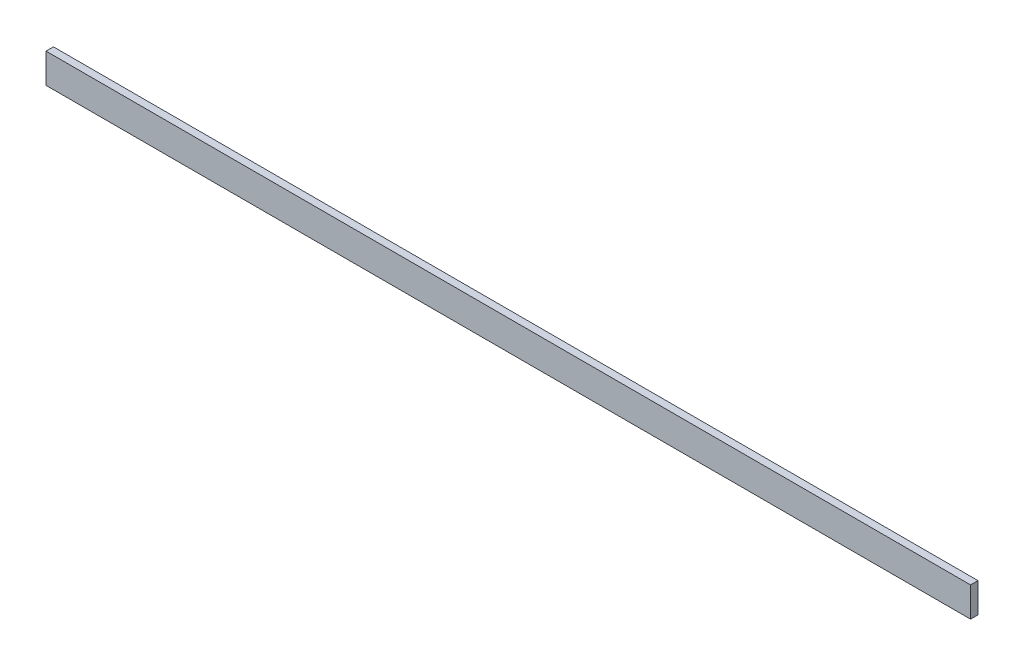
ISO-10303-21;
HEADER;
FILE_DESCRIPTION(('STEP AP214'),'2;1');
FILE_NAME('part.step','',(''),(''),'','','');
FILE_SCHEMA(('AUTOMOTIVE_DESIGN { 1 0 10303 214 1 1 1 1 }'));
ENDSEC;
DATA;
#1=APPLICATION_CONTEXT('core data for automotive mechanical design processes');
#2=APPLICATION_PROTOCOL_DEFINITION('international standard','automotive_design',2000,#1);
#3=PRODUCT_CONTEXT('',#1,'mechanical');
#4=PRODUCT('Part','Part','',(#3));
#5=PRODUCT_RELATED_PRODUCT_CATEGORY('part','',(#4));
#6=PRODUCT_DEFINITION_FORMATION('','',#4);
#7=PRODUCT_DEFINITION_CONTEXT('part definition',#1,'design');
#8=PRODUCT_DEFINITION('design','',#6,#7);
#9=PRODUCT_DEFINITION_SHAPE('','',#8);
#10=(LENGTH_UNIT() NAMED_UNIT(*) SI_UNIT(.MILLI.,.METRE.));
#11=(NAMED_UNIT(*) PLANE_ANGLE_UNIT() SI_UNIT($,.RADIAN.));
#12=(NAMED_UNIT(*) SI_UNIT($,.STERADIAN.) SOLID_ANGLE_UNIT());
#13=UNCERTAINTY_MEASURE_WITH_UNIT(LENGTH_MEASURE(1.E-05),#10,'distance_accuracy_value','');
#14=(GEOMETRIC_REPRESENTATION_CONTEXT(3) GLOBAL_UNCERTAINTY_ASSIGNED_CONTEXT((#13)) GLOBAL_UNIT_ASSIGNED_CONTEXT((#10,
#11,#12)) REPRESENTATION_CONTEXT('',''));
#15=CARTESIAN_POINT('',(0.,0.,0.));
#16=DIRECTION('',(0.,0.,1.));
#17=DIRECTION('',(1.,0.,0.));
#18=AXIS2_PLACEMENT_3D('',#15,#16,#17);
#19=CARTESIAN_POINT('',(39.6875,303.699000032,3.175));
#20=DIRECTION('',(-1.,0.,0.));
#21=DIRECTION('',(0.,0.,1.));
#22=AXIS2_PLACEMENT_3D('',#19,#20,#21);
#23=PLANE('',#22);
#24=DIRECTION('',(0.,1.,0.));
#25=VECTOR('',#24,1.);
#26=CARTESIAN_POINT('',(39.6875,303.699000032,0.));
#27=LINE('',#26,#25);
#28=CARTESIAN_POINT('',(39.6875,290.999000032,0.));
#29=VERTEX_POINT('',#28);
#30=CARTESIAN_POINT('',(39.6875,303.699000032,0.));
#31=VERTEX_POINT('',#30);
#32=EDGE_CURVE('E96',#29,#31,#27,.T.);
#33=ORIENTED_EDGE('',*,*,#32,.T.);
#34=DIRECTION('',(0.,0.,-1.));
#35=VECTOR('',#34,1.);
#36=CARTESIAN_POINT('',(39.6875,303.699000032,3.175));
#37=LINE('',#36,#35);
#38=CARTESIAN_POINT('',(39.6875,303.699000032,3.175));
#39=VERTEX_POINT('',#38);
#40=EDGE_CURVE('E11',#39,#31,#37,.T.);
#41=ORIENTED_EDGE('',*,*,#40,.F.);
#42=DIRECTION('',(0.,1.,0.));
#43=VECTOR('',#42,1.);
#44=CARTESIAN_POINT('',(39.6875,303.699000032,3.175));
#45=LINE('',#44,#43);
#46=CARTESIAN_POINT('',(39.6875,290.999000032,3.175));
#47=VERTEX_POINT('',#46);
#48=EDGE_CURVE('E84',#47,#39,#45,.T.);
#49=ORIENTED_EDGE('',*,*,#48,.F.);
#50=DIRECTION('',(0.,0.,-1.));
#51=VECTOR('',#50,1.);
#52=CARTESIAN_POINT('',(39.6875,290.999000032,3.175));
#53=LINE('',#52,#51);
#54=EDGE_CURVE('E92',#47,#29,#53,.T.);
#55=ORIENTED_EDGE('',*,*,#54,.T.);
#56=EDGE_LOOP('',(#33,#41,#49,#55));
#57=FACE_BOUND('',#56,.T.);
#58=ADVANCED_FACE('F33',(#57),#23,.F.);
#59=CARTESIAN_POINT('',(39.6875,303.699000032,3.175));
#60=DIRECTION('',(0.,-1.,0.));
#61=DIRECTION('',(1.,0.,0.));
#62=AXIS2_PLACEMENT_3D('',#59,#60,#61);
#63=PLANE('',#62);
#64=DIRECTION('',(-1.,0.,0.));
#65=VECTOR('',#64,1.);
#66=CARTESIAN_POINT('',(39.6875,303.699000032,0.));
#67=LINE('',#66,#65);
#68=CARTESIAN_POINT('',(-355.787500000039,303.699000032,0.));
#69=VERTEX_POINT('',#68);
#70=EDGE_CURVE('E88',#31,#69,#67,.T.);
#71=ORIENTED_EDGE('',*,*,#70,.T.);
#72=DIRECTION('',(0.,0.,-1.));
#73=VECTOR('',#72,1.);
#74=CARTESIAN_POINT('',(-355.787500000039,303.699000032,3.175));
#75=LINE('',#74,#73);
#76=CARTESIAN_POINT('',(-355.787500000039,303.699000032,3.175));
#77=VERTEX_POINT('',#76);
#78=EDGE_CURVE('E41',#77,#69,#75,.T.);
#79=ORIENTED_EDGE('',*,*,#78,.F.);
#80=DIRECTION('',(-1.,0.,0.));
#81=VECTOR('',#80,1.);
#82=CARTESIAN_POINT('',(39.6875,303.699000032,3.175));
#83=LINE('',#82,#81);
#84=EDGE_CURVE('E79',#39,#77,#83,.T.);
#85=ORIENTED_EDGE('',*,*,#84,.F.);
#86=ORIENTED_EDGE('',*,*,#40,.T.);
#87=EDGE_LOOP('',(#71,#79,#85,#86));
#88=FACE_BOUND('',#87,.T.);
#89=ADVANCED_FACE('F87',(#88),#63,.F.);
#90=CARTESIAN_POINT('',(-355.787500000039,303.699000032,3.175));
#91=DIRECTION('',(1.,0.,0.));
#92=DIRECTION('',(0.,0.,-1.));
#93=AXIS2_PLACEMENT_3D('',#90,#91,#92);
#94=PLANE('',#93);
#95=DIRECTION('',(0.,-1.,0.));
#96=VECTOR('',#95,1.);
#97=CARTESIAN_POINT('',(-355.787500000039,303.699000032,0.));
#98=LINE('',#97,#96);
#99=CARTESIAN_POINT('',(-355.787500000039,290.999000032,0.));
#100=VERTEX_POINT('',#99);
#101=EDGE_CURVE('E66',#69,#100,#98,.T.);
#102=ORIENTED_EDGE('',*,*,#101,.T.);
#103=DIRECTION('',(0.,0.,-1.));
#104=VECTOR('',#103,1.);
#105=CARTESIAN_POINT('',(-355.787500000039,290.999000032,3.175));
#106=LINE('',#105,#104);
#107=CARTESIAN_POINT('',(-355.787500000039,290.999000032,3.175));
#108=VERTEX_POINT('',#107);
#109=EDGE_CURVE('E89',#108,#100,#106,.T.);
#110=ORIENTED_EDGE('',*,*,#109,.F.);
#111=DIRECTION('',(0.,-1.,0.));
#112=VECTOR('',#111,1.);
#113=CARTESIAN_POINT('',(-355.787500000039,303.699000032,3.175));
#114=LINE('',#113,#112);
#115=EDGE_CURVE('E82',#77,#108,#114,.T.);
#116=ORIENTED_EDGE('',*,*,#115,.F.);
#117=ORIENTED_EDGE('',*,*,#78,.T.);
#118=EDGE_LOOP('',(#102,#110,#116,#117));
#119=FACE_BOUND('',#118,.T.);
#120=ADVANCED_FACE('F90',(#119),#94,.F.);
#121=CARTESIAN_POINT('',(39.6875,290.999000032,3.175));
#122=DIRECTION('',(0.,1.,0.));
#123=DIRECTION('',(-1.,0.,0.));
#124=AXIS2_PLACEMENT_3D('',#121,#122,#123);
#125=PLANE('',#124);
#126=DIRECTION('',(1.,0.,0.));
#127=VECTOR('',#126,1.);
#128=CARTESIAN_POINT('',(39.6875,290.999000032,0.));
#129=LINE('',#128,#127);
#130=EDGE_CURVE('E72',#100,#29,#129,.T.);
#131=ORIENTED_EDGE('',*,*,#130,.T.);
#132=ORIENTED_EDGE('',*,*,#54,.F.);
#133=DIRECTION('',(1.,0.,0.));
#134=VECTOR('',#133,1.);
#135=CARTESIAN_POINT('',(39.6875,290.999000032,3.175));
#136=LINE('',#135,#134);
#137=EDGE_CURVE('E49',#108,#47,#136,.T.);
#138=ORIENTED_EDGE('',*,*,#137,.F.);
#139=ORIENTED_EDGE('',*,*,#109,.T.);
#140=EDGE_LOOP('',(#131,#132,#138,#139));
#141=FACE_BOUND('',#140,.T.);
#142=ADVANCED_FACE('F103',(#141),#125,.F.);
#143=CARTESIAN_POINT('',(0.,0.,3.175));
#144=DIRECTION('',(0.,0.,-1.));
#145=DIRECTION('',(-1.,0.,0.));
#146=AXIS2_PLACEMENT_3D('',#143,#144,#145);
#147=PLANE('',#146);
#148=ORIENTED_EDGE('',*,*,#48,.T.);
#149=ORIENTED_EDGE('',*,*,#84,.T.);
#150=ORIENTED_EDGE('',*,*,#115,.T.);
#151=ORIENTED_EDGE('',*,*,#137,.T.);
#152=EDGE_LOOP('',(#148,#149,#150,#151));
#153=FACE_BOUND('',#152,.T.);
#154=ADVANCED_FACE('F80',(#153),#147,.F.);
#155=CARTESIAN_POINT('',(0.,0.,0.));
#156=DIRECTION('',(0.,0.,-1.));
#157=DIRECTION('',(-1.,0.,0.));
#158=AXIS2_PLACEMENT_3D('',#155,#156,#157);
#159=PLANE('',#158);
#160=ORIENTED_EDGE('',*,*,#32,.F.);
#161=ORIENTED_EDGE('',*,*,#130,.F.);
#162=ORIENTED_EDGE('',*,*,#101,.F.);
#163=ORIENTED_EDGE('',*,*,#70,.F.);
#164=EDGE_LOOP('',(#160,#161,#162,#163));
#165=FACE_BOUND('',#164,.T.);
#166=ADVANCED_FACE('F106',(#165),#159,.T.);
#167=CLOSED_SHELL('',(#58,#89,#120,#142,#154,#166));
#168=MANIFOLD_SOLID_BREP('B2',#167);
#169=ADVANCED_BREP_SHAPE_REPRESENTATION('',(#18,#168),#14);
#170=SHAPE_DEFINITION_REPRESENTATION(#9,#169);
ENDSEC;
END-ISO-10303-21;
